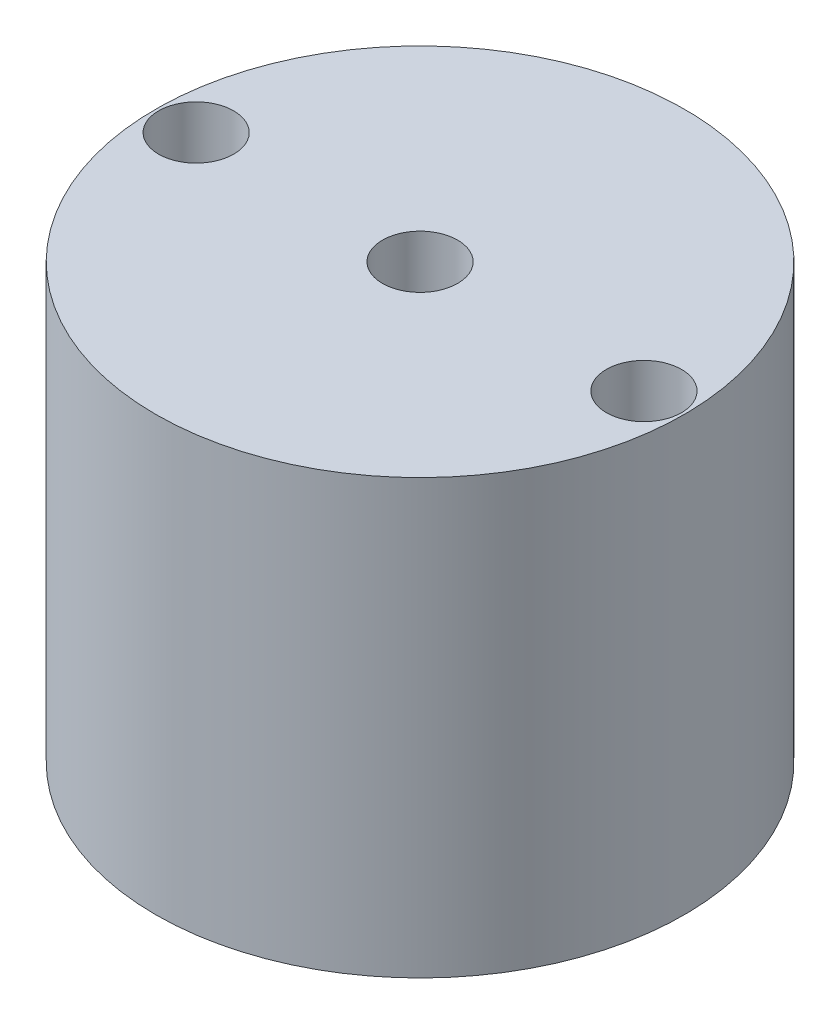
ISO-10303-21;
HEADER;
FILE_DESCRIPTION(('STEP AP214'),'2;1');
FILE_NAME('part.step','',(''),(''),'','','');
FILE_SCHEMA(('AUTOMOTIVE_DESIGN { 1 0 10303 214 1 1 1 1 }'));
ENDSEC;
DATA;
#1=APPLICATION_CONTEXT('core data for automotive mechanical design processes');
#2=APPLICATION_PROTOCOL_DEFINITION('international standard','automotive_design',2000,#1);
#3=PRODUCT_CONTEXT('',#1,'mechanical');
#4=PRODUCT('Part','Part','',(#3));
#5=PRODUCT_RELATED_PRODUCT_CATEGORY('part','',(#4));
#6=PRODUCT_DEFINITION_FORMATION('','',#4);
#7=PRODUCT_DEFINITION_CONTEXT('part definition',#1,'design');
#8=PRODUCT_DEFINITION('design','',#6,#7);
#9=PRODUCT_DEFINITION_SHAPE('','',#8);
#10=(LENGTH_UNIT() NAMED_UNIT(*) SI_UNIT(.MILLI.,.METRE.));
#11=(NAMED_UNIT(*) PLANE_ANGLE_UNIT() SI_UNIT($,.RADIAN.));
#12=(NAMED_UNIT(*) SI_UNIT($,.STERADIAN.) SOLID_ANGLE_UNIT());
#13=UNCERTAINTY_MEASURE_WITH_UNIT(LENGTH_MEASURE(1.E-05),#10,'distance_accuracy_value','');
#14=(GEOMETRIC_REPRESENTATION_CONTEXT(3) GLOBAL_UNCERTAINTY_ASSIGNED_CONTEXT((#13)) GLOBAL_UNIT_ASSIGNED_CONTEXT((#10,
#11,#12)) REPRESENTATION_CONTEXT('',''));
#15=CARTESIAN_POINT('',(0.,0.,0.));
#16=DIRECTION('',(0.,0.,1.));
#17=DIRECTION('',(1.,0.,0.));
#18=AXIS2_PLACEMENT_3D('',#15,#16,#17);
#19=CARTESIAN_POINT('',(0.,38.1,0.));
#20=DIRECTION('',(0.,-1.,0.));
#21=DIRECTION('',(0.,0.,-1.));
#22=AXIS2_PLACEMENT_3D('',#19,#20,#21);
#23=CYLINDRICAL_SURFACE('',#22,23.241);
#24=CARTESIAN_POINT('',(0.,38.1,0.));
#25=DIRECTION('',(0.,1.,0.));
#26=DIRECTION('',(0.,0.,1.));
#27=AXIS2_PLACEMENT_3D('',#24,#25,#26);
#28=CIRCLE('',#27,23.241);
#29=CARTESIAN_POINT('',(0.,38.1,23.241));
#30=VERTEX_POINT('',#29);
#31=EDGE_CURVE('E10',#30,#30,#28,.T.);
#32=ORIENTED_EDGE('',*,*,#31,.F.);
#33=EDGE_LOOP('',(#32));
#34=FACE_BOUND('',#33,.T.);
#35=CARTESIAN_POINT('',(0.,0.,0.));
#36=DIRECTION('',(0.,1.,0.));
#37=DIRECTION('',(0.,0.,1.));
#38=AXIS2_PLACEMENT_3D('',#35,#36,#37);
#39=CIRCLE('',#38,23.241);
#40=CARTESIAN_POINT('',(0.,0.,23.241));
#41=VERTEX_POINT('',#40);
#42=EDGE_CURVE('E40',#41,#41,#39,.T.);
#43=ORIENTED_EDGE('',*,*,#42,.T.);
#44=EDGE_LOOP('',(#43));
#45=FACE_BOUND('',#44,.T.);
#46=ADVANCED_FACE('F37',(#34,#45),#23,.T.);
#47=CARTESIAN_POINT('',(0.,38.1,0.));
#48=DIRECTION('',(0.,1.,0.));
#49=DIRECTION('',(0.,0.,1.));
#50=AXIS2_PLACEMENT_3D('',#47,#48,#49);
#51=PLANE('',#50);
#52=CARTESIAN_POINT('',(0.,38.1,0.));
#53=DIRECTION('',(0.,1.,0.));
#54=DIRECTION('',(0.,0.,1.));
#55=AXIS2_PLACEMENT_3D('',#52,#53,#54);
#56=CIRCLE('',#55,3.302);
#57=CARTESIAN_POINT('',(0.,38.1,3.302));
#58=VERTEX_POINT('',#57);
#59=EDGE_CURVE('E63',#58,#58,#56,.T.);
#60=ORIENTED_EDGE('',*,*,#59,.F.);
#61=EDGE_LOOP('',(#60));
#62=FACE_BOUND('',#61,.T.);
#63=CARTESIAN_POINT('',(19.685,38.1,0.));
#64=DIRECTION('',(0.,1.,0.));
#65=DIRECTION('',(0.,0.,1.));
#66=AXIS2_PLACEMENT_3D('',#63,#64,#65);
#67=CIRCLE('',#66,3.302);
#68=CARTESIAN_POINT('',(19.685,38.1,3.302));
#69=VERTEX_POINT('',#68);
#70=EDGE_CURVE('E52',#69,#69,#67,.T.);
#71=ORIENTED_EDGE('',*,*,#70,.F.);
#72=EDGE_LOOP('',(#71));
#73=FACE_BOUND('',#72,.T.);
#74=CARTESIAN_POINT('',(-19.685,38.1,0.));
#75=DIRECTION('',(0.,1.,0.));
#76=DIRECTION('',(0.,0.,1.));
#77=AXIS2_PLACEMENT_3D('',#74,#75,#76);
#78=CIRCLE('',#77,3.302);
#79=CARTESIAN_POINT('',(-19.685,38.1,3.302));
#80=VERTEX_POINT('',#79);
#81=EDGE_CURVE('E49',#80,#80,#78,.T.);
#82=ORIENTED_EDGE('',*,*,#81,.F.);
#83=EDGE_LOOP('',(#82));
#84=FACE_BOUND('',#83,.T.);
#85=ORIENTED_EDGE('',*,*,#31,.T.);
#86=EDGE_LOOP('',(#85));
#87=FACE_BOUND('',#86,.T.);
#88=ADVANCED_FACE('F70',(#62,#73,#84,#87),#51,.T.);
#89=CARTESIAN_POINT('',(0.,0.,0.));
#90=DIRECTION('',(0.,1.,0.));
#91=DIRECTION('',(0.,0.,1.));
#92=AXIS2_PLACEMENT_3D('',#89,#90,#91);
#93=PLANE('',#92);
#94=CARTESIAN_POINT('',(0.,0.,0.));
#95=DIRECTION('',(0.,1.,0.));
#96=DIRECTION('',(0.,0.,1.));
#97=AXIS2_PLACEMENT_3D('',#94,#95,#96);
#98=CIRCLE('',#97,3.302);
#99=CARTESIAN_POINT('',(0.,0.,3.302));
#100=VERTEX_POINT('',#99);
#101=EDGE_CURVE('E56',#100,#100,#98,.F.);
#102=ORIENTED_EDGE('',*,*,#101,.F.);
#103=EDGE_LOOP('',(#102));
#104=FACE_BOUND('',#103,.T.);
#105=CARTESIAN_POINT('',(19.685,0.,0.));
#106=DIRECTION('',(0.,1.,0.));
#107=DIRECTION('',(0.,0.,1.));
#108=AXIS2_PLACEMENT_3D('',#105,#106,#107);
#109=CIRCLE('',#108,3.302);
#110=CARTESIAN_POINT('',(19.685,0.,3.302));
#111=VERTEX_POINT('',#110);
#112=EDGE_CURVE('E47',#111,#111,#109,.F.);
#113=ORIENTED_EDGE('',*,*,#112,.F.);
#114=EDGE_LOOP('',(#113));
#115=FACE_BOUND('',#114,.T.);
#116=CARTESIAN_POINT('',(-19.685,0.,0.));
#117=DIRECTION('',(0.,1.,0.));
#118=DIRECTION('',(0.,0.,1.));
#119=AXIS2_PLACEMENT_3D('',#116,#117,#118);
#120=CIRCLE('',#119,3.302);
#121=CARTESIAN_POINT('',(-19.685,0.,3.302));
#122=VERTEX_POINT('',#121);
#123=EDGE_CURVE('E53',#122,#122,#120,.F.);
#124=ORIENTED_EDGE('',*,*,#123,.F.);
#125=EDGE_LOOP('',(#124));
#126=FACE_BOUND('',#125,.T.);
#127=ORIENTED_EDGE('',*,*,#42,.F.);
#128=EDGE_LOOP('',(#127));
#129=FACE_BOUND('',#128,.T.);
#130=ADVANCED_FACE('F73',(#104,#115,#126,#129),#93,.F.);
#131=CARTESIAN_POINT('',(-19.685,-0.001000000000001,0.));
#132=DIRECTION('',(0.,1.,0.));
#133=DIRECTION('',(0.,0.,1.));
#134=AXIS2_PLACEMENT_3D('',#131,#132,#133);
#135=CYLINDRICAL_SURFACE('',#134,3.302);
#136=ORIENTED_EDGE('',*,*,#81,.T.);
#137=EDGE_LOOP('',(#136));
#138=FACE_BOUND('',#137,.T.);
#139=ORIENTED_EDGE('',*,*,#123,.T.);
#140=EDGE_LOOP('',(#139));
#141=FACE_BOUND('',#140,.T.);
#142=ADVANCED_FACE('F79',(#138,#141),#135,.F.);
#143=CARTESIAN_POINT('',(19.685,-0.001000000000001,0.));
#144=DIRECTION('',(0.,1.,0.));
#145=DIRECTION('',(0.,0.,1.));
#146=AXIS2_PLACEMENT_3D('',#143,#144,#145);
#147=CYLINDRICAL_SURFACE('',#146,3.302);
#148=ORIENTED_EDGE('',*,*,#70,.T.);
#149=EDGE_LOOP('',(#148));
#150=FACE_BOUND('',#149,.T.);
#151=ORIENTED_EDGE('',*,*,#112,.T.);
#152=EDGE_LOOP('',(#151));
#153=FACE_BOUND('',#152,.T.);
#154=ADVANCED_FACE('F82',(#150,#153),#147,.F.);
#155=CARTESIAN_POINT('',(0.,-0.001000000000001,0.));
#156=DIRECTION('',(0.,1.,0.));
#157=DIRECTION('',(0.,0.,1.));
#158=AXIS2_PLACEMENT_3D('',#155,#156,#157);
#159=CYLINDRICAL_SURFACE('',#158,3.302);
#160=ORIENTED_EDGE('',*,*,#59,.T.);
#161=EDGE_LOOP('',(#160));
#162=FACE_BOUND('',#161,.T.);
#163=ORIENTED_EDGE('',*,*,#101,.T.);
#164=EDGE_LOOP('',(#163));
#165=FACE_BOUND('',#164,.T.);
#166=ADVANCED_FACE('F67',(#162,#165),#159,.F.);
#167=CLOSED_SHELL('',(#46,#88,#130,#142,#154,#166));
#168=MANIFOLD_SOLID_BREP('B2',#167);
#169=ADVANCED_BREP_SHAPE_REPRESENTATION('',(#18,#168),#14);
#170=SHAPE_DEFINITION_REPRESENTATION(#9,#169);
ENDSEC;
END-ISO-10303-21;
